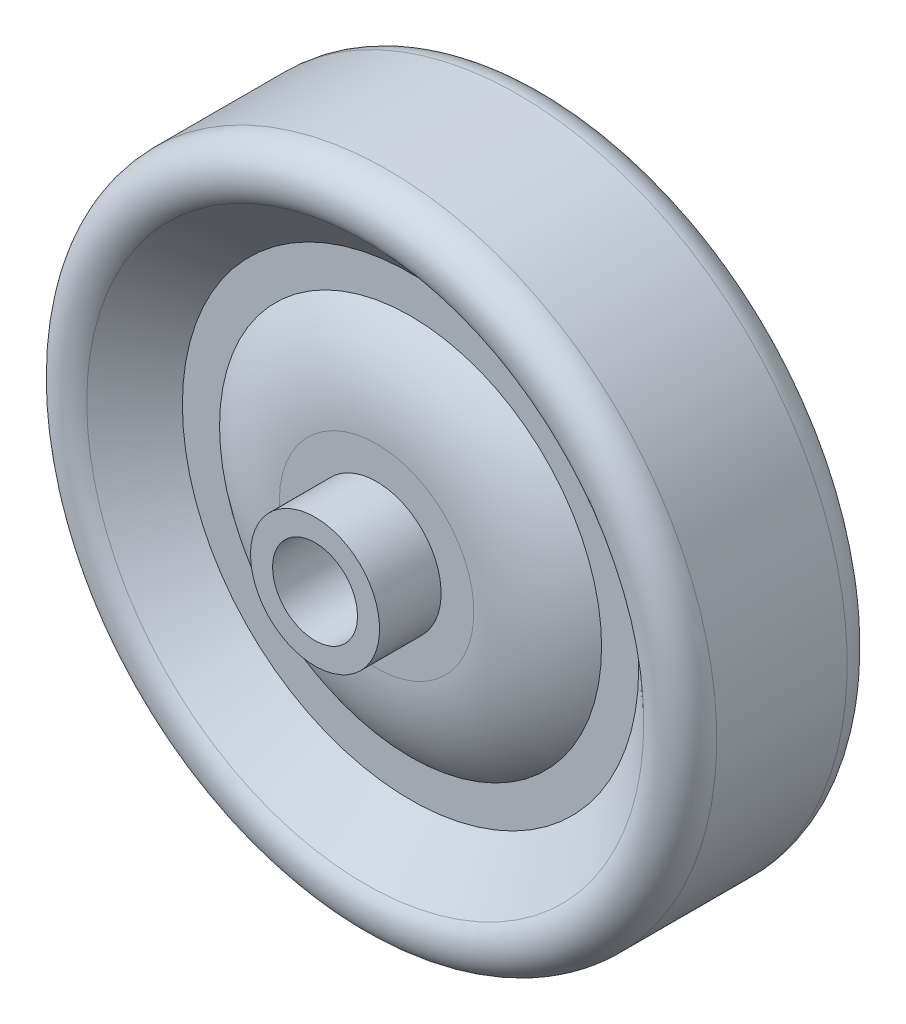
ISO-10303-21;
HEADER;
FILE_DESCRIPTION(('STEP AP214'),'2;1');
FILE_NAME('part.step','',(''),(''),'','','');
FILE_SCHEMA(('AUTOMOTIVE_DESIGN { 1 0 10303 214 1 1 1 1 }'));
ENDSEC;
DATA;
#1=APPLICATION_CONTEXT('core data for automotive mechanical design processes');
#2=APPLICATION_PROTOCOL_DEFINITION('international standard','automotive_design',2000,#1);
#3=PRODUCT_CONTEXT('',#1,'mechanical');
#4=PRODUCT('Part','Part','',(#3));
#5=PRODUCT_RELATED_PRODUCT_CATEGORY('part','',(#4));
#6=PRODUCT_DEFINITION_FORMATION('','',#4);
#7=PRODUCT_DEFINITION_CONTEXT('part definition',#1,'design');
#8=PRODUCT_DEFINITION('design','',#6,#7);
#9=PRODUCT_DEFINITION_SHAPE('','',#8);
#10=(LENGTH_UNIT() NAMED_UNIT(*) SI_UNIT(.MILLI.,.METRE.));
#11=(NAMED_UNIT(*) PLANE_ANGLE_UNIT() SI_UNIT($,.RADIAN.));
#12=(NAMED_UNIT(*) SI_UNIT($,.STERADIAN.) SOLID_ANGLE_UNIT());
#13=UNCERTAINTY_MEASURE_WITH_UNIT(LENGTH_MEASURE(1.E-05),#10,'distance_accuracy_value','');
#14=(GEOMETRIC_REPRESENTATION_CONTEXT(3) GLOBAL_UNCERTAINTY_ASSIGNED_CONTEXT((#13)) GLOBAL_UNIT_ASSIGNED_CONTEXT((#10,
#11,#12)) REPRESENTATION_CONTEXT('',''));
#15=CARTESIAN_POINT('',(0.,0.,0.));
#16=DIRECTION('',(0.,0.,1.));
#17=DIRECTION('',(1.,0.,0.));
#18=AXIS2_PLACEMENT_3D('',#15,#16,#17);
#19=CARTESIAN_POINT('',(0.,0.,-10.31875));
#20=DIRECTION('',(0.,0.,-1.));
#21=DIRECTION('',(-1.,0.,0.));
#22=AXIS2_PLACEMENT_3D('',#19,#20,#21);
#23=CYLINDRICAL_SURFACE('',#22,24.60625);
#24=CARTESIAN_POINT('',(0.,0.,-4.88156249999999));
#25=DIRECTION('',(0.,0.,-1.));
#26=DIRECTION('',(-1.,0.,0.));
#27=AXIS2_PLACEMENT_3D('',#24,#25,#26);
#28=CIRCLE('',#27,24.60625);
#29=CARTESIAN_POINT('',(-24.60625,0.,-4.88156249999999));
#30=VERTEX_POINT('',#29);
#31=EDGE_CURVE('E12',#30,#30,#28,.T.);
#32=ORIENTED_EDGE('',*,*,#31,.F.);
#33=EDGE_LOOP('',(#32));
#34=FACE_BOUND('',#33,.T.);
#35=CARTESIAN_POINT('',(0.,0.,4.88156249999999));
#36=DIRECTION('',(0.,0.,-1.));
#37=DIRECTION('',(-1.,0.,0.));
#38=AXIS2_PLACEMENT_3D('',#35,#36,#37);
#39=CIRCLE('',#38,24.60625);
#40=CARTESIAN_POINT('',(-24.60625,0.,4.88156249999999));
#41=VERTEX_POINT('',#40);
#42=EDGE_CURVE('E73',#41,#41,#39,.T.);
#43=ORIENTED_EDGE('',*,*,#42,.T.);
#44=EDGE_LOOP('',(#43));
#45=FACE_BOUND('',#44,.T.);
#46=ADVANCED_FACE('F42',(#34,#45),#23,.T.);
#47=CARTESIAN_POINT('',(0.,0.,-4.88156249999999));
#48=DIRECTION('',(0.,0.,-1.));
#49=DIRECTION('',(-1.,0.,0.));
#50=AXIS2_PLACEMENT_3D('',#47,#48,#49);
#51=TOROIDAL_SURFACE('',#50,22.3440625,2.2621875);
#52=ORIENTED_EDGE('',*,*,#31,.T.);
#53=EDGE_LOOP('',(#52));
#54=FACE_BOUND('',#53,.T.);
#55=CARTESIAN_POINT('',(0.,0.,-6.56315963348468));
#56=DIRECTION('',(0.,0.,-1.));
#57=DIRECTION('',(-1.,0.,0.));
#58=AXIS2_PLACEMENT_3D('',#55,#56,#57);
#59=CIRCLE('',#58,20.8308793102268);
#60=CARTESIAN_POINT('',(-20.8308793102268,0.,-6.56315963348468));
#61=VERTEX_POINT('',#60);
#62=EDGE_CURVE('E48',#61,#61,#59,.T.);
#63=ORIENTED_EDGE('',*,*,#62,.F.);
#64=EDGE_LOOP('',(#63));
#65=FACE_BOUND('',#64,.T.);
#66=ADVANCED_FACE('F117',(#54,#65),#51,.T.);
#67=CARTESIAN_POINT('',(0.,0.,-3.17499999999999));
#68=DIRECTION('',(0.,0.,-1.));
#69=DIRECTION('',(-1.,0.,0.));
#70=AXIS2_PLACEMENT_3D('',#67,#68,#69);
#71=CONICAL_SURFACE('',#70,17.065625,0.838064758287936);
#72=ORIENTED_EDGE('',*,*,#62,.T.);
#73=EDGE_LOOP('',(#72));
#74=FACE_BOUND('',#73,.T.);
#75=CARTESIAN_POINT('',(0.,0.,-3.17499999999999));
#76=DIRECTION('',(0.,0.,-1.));
#77=DIRECTION('',(-1.,0.,0.));
#78=AXIS2_PLACEMENT_3D('',#75,#76,#77);
#79=CIRCLE('',#78,17.065625);
#80=CARTESIAN_POINT('',(-17.065625,0.,-3.17499999999999));
#81=VERTEX_POINT('',#80);
#82=EDGE_CURVE('E52',#81,#81,#79,.T.);
#83=ORIENTED_EDGE('',*,*,#82,.F.);
#84=EDGE_LOOP('',(#83));
#85=FACE_BOUND('',#84,.T.);
#86=ADVANCED_FACE('F122',(#74,#85),#71,.F.);
#87=CARTESIAN_POINT('',(0.,-14.2875,-3.17499999999999));
#88=DIRECTION('',(0.,0.,-1.));
#89=DIRECTION('',(-1.,0.,0.));
#90=AXIS2_PLACEMENT_3D('',#87,#88,#89);
#91=PLANE('',#90);
#92=ORIENTED_EDGE('',*,*,#82,.T.);
#93=EDGE_LOOP('',(#92));
#94=FACE_BOUND('',#93,.T.);
#95=CARTESIAN_POINT('',(0.,0.,-3.17499999999999));
#96=DIRECTION('',(0.,0.,-1.));
#97=DIRECTION('',(-1.,0.,0.));
#98=AXIS2_PLACEMENT_3D('',#95,#96,#97);
#99=CIRCLE('',#98,14.2875);
#100=CARTESIAN_POINT('',(-14.2875,0.,-3.17499999999999));
#101=VERTEX_POINT('',#100);
#102=EDGE_CURVE('E56',#101,#101,#99,.T.);
#103=ORIENTED_EDGE('',*,*,#102,.F.);
#104=EDGE_LOOP('',(#103));
#105=FACE_BOUND('',#104,.T.);
#106=ADVANCED_FACE('F222',(#94,#105),#91,.T.);
#107=CARTESIAN_POINT('',(0.,0.,5.25045778842444));
#108=DIRECTION('',(0.,0.,-1.));
#109=DIRECTION('',(-1.,0.,0.));
#110=AXIS2_PLACEMENT_3D('',#107,#108,#109);
#111=DEGENERATE_TOROIDAL_SURFACE('',#110,7.26945714139644,10.9654577884244,.T.);
#112=ORIENTED_EDGE('',*,*,#102,.T.);
#113=EDGE_LOOP('',(#112));
#114=FACE_BOUND('',#113,.T.);
#115=CARTESIAN_POINT('',(0.,0.,-5.715));
#116=DIRECTION('',(0.,0.,-1.));
#117=DIRECTION('',(-1.,0.,0.));
#118=AXIS2_PLACEMENT_3D('',#115,#116,#117);
#119=CIRCLE('',#118,7.26945714139644);
#120=CARTESIAN_POINT('',(-7.26945714139644,0.,-5.715));
#121=VERTEX_POINT('',#120);
#122=EDGE_CURVE('E61',#121,#121,#119,.T.);
#123=ORIENTED_EDGE('',*,*,#122,.F.);
#124=EDGE_LOOP('',(#123));
#125=FACE_BOUND('',#124,.T.);
#126=ADVANCED_FACE('F213',(#114,#125),#111,.T.);
#127=CARTESIAN_POINT('',(0.,-7.26945714139645,-5.715));
#128=DIRECTION('',(0.,0.,-1.));
#129=DIRECTION('',(-1.,0.,0.));
#130=AXIS2_PLACEMENT_3D('',#127,#128,#129);
#131=PLANE('',#130);
#132=ORIENTED_EDGE('',*,*,#122,.T.);
#133=EDGE_LOOP('',(#132));
#134=FACE_BOUND('',#133,.T.);
#135=CARTESIAN_POINT('',(0.,0.,-5.715));
#136=DIRECTION('',(0.,0.,-1.));
#137=DIRECTION('',(-1.,0.,0.));
#138=AXIS2_PLACEMENT_3D('',#135,#136,#137);
#139=CIRCLE('',#138,4.826);
#140=CARTESIAN_POINT('',(-4.826,0.,-5.715));
#141=VERTEX_POINT('',#140);
#142=EDGE_CURVE('E64',#141,#141,#139,.T.);
#143=ORIENTED_EDGE('',*,*,#142,.F.);
#144=EDGE_LOOP('',(#143));
#145=FACE_BOUND('',#144,.T.);
#146=ADVANCED_FACE('F204',(#134,#145),#131,.T.);
#147=CARTESIAN_POINT('',(0.,0.,-10.31875));
#148=DIRECTION('',(0.,0.,-1.));
#149=DIRECTION('',(-1.,0.,0.));
#150=AXIS2_PLACEMENT_3D('',#147,#148,#149);
#151=CYLINDRICAL_SURFACE('',#150,4.826);
#152=ORIENTED_EDGE('',*,*,#142,.T.);
#153=EDGE_LOOP('',(#152));
#154=FACE_BOUND('',#153,.T.);
#155=CARTESIAN_POINT('',(0.,0.,-10.31875));
#156=DIRECTION('',(0.,0.,-1.));
#157=DIRECTION('',(-1.,0.,0.));
#158=AXIS2_PLACEMENT_3D('',#155,#156,#157);
#159=CIRCLE('',#158,4.826);
#160=CARTESIAN_POINT('',(-4.826,0.,-10.31875));
#161=VERTEX_POINT('',#160);
#162=EDGE_CURVE('E67',#161,#161,#159,.T.);
#163=ORIENTED_EDGE('',*,*,#162,.F.);
#164=EDGE_LOOP('',(#163));
#165=FACE_BOUND('',#164,.T.);
#166=ADVANCED_FACE('F113',(#154,#165),#151,.T.);
#167=CARTESIAN_POINT('',(0.,-3.175,-10.31875));
#168=DIRECTION('',(0.,0.,-1.));
#169=DIRECTION('',(-1.,0.,0.));
#170=AXIS2_PLACEMENT_3D('',#167,#168,#169);
#171=PLANE('',#170);
#172=ORIENTED_EDGE('',*,*,#162,.T.);
#173=EDGE_LOOP('',(#172));
#174=FACE_BOUND('',#173,.T.);
#175=CARTESIAN_POINT('',(0.,0.,-10.31875));
#176=DIRECTION('',(0.,0.,-1.));
#177=DIRECTION('',(-1.,0.,0.));
#178=AXIS2_PLACEMENT_3D('',#175,#176,#177);
#179=CIRCLE('',#178,3.175);
#180=CARTESIAN_POINT('',(-3.175,0.,-10.31875));
#181=VERTEX_POINT('',#180);
#182=EDGE_CURVE('E70',#181,#181,#179,.T.);
#183=ORIENTED_EDGE('',*,*,#182,.F.);
#184=EDGE_LOOP('',(#183));
#185=FACE_BOUND('',#184,.T.);
#186=ADVANCED_FACE('F103',(#174,#185),#171,.T.);
#187=CARTESIAN_POINT('',(0.,0.,-10.31875));
#188=DIRECTION('',(0.,0.,-1.));
#189=DIRECTION('',(-1.,0.,0.));
#190=AXIS2_PLACEMENT_3D('',#187,#188,#189);
#191=CYLINDRICAL_SURFACE('',#190,3.175);
#192=ORIENTED_EDGE('',*,*,#182,.T.);
#193=EDGE_LOOP('',(#192));
#194=FACE_BOUND('',#193,.T.);
#195=CARTESIAN_POINT('',(0.,0.,10.31875));
#196=DIRECTION('',(0.,0.,-1.));
#197=DIRECTION('',(-1.,0.,0.));
#198=AXIS2_PLACEMENT_3D('',#195,#196,#197);
#199=CIRCLE('',#198,3.175);
#200=CARTESIAN_POINT('',(-3.175,0.,10.31875));
#201=VERTEX_POINT('',#200);
#202=EDGE_CURVE('E94',#201,#201,#199,.T.);
#203=ORIENTED_EDGE('',*,*,#202,.F.);
#204=EDGE_LOOP('',(#203));
#205=FACE_BOUND('',#204,.T.);
#206=ADVANCED_FACE('F100',(#194,#205),#191,.F.);
#207=CARTESIAN_POINT('',(0.,0.,4.88156249999999));
#208=DIRECTION('',(0.,0.,1.));
#209=DIRECTION('',(-1.,0.,0.));
#210=AXIS2_PLACEMENT_3D('',#207,#208,#209);
#211=TOROIDAL_SURFACE('',#210,22.3440625,2.2621875);
#212=ORIENTED_EDGE('',*,*,#42,.F.);
#213=EDGE_LOOP('',(#212));
#214=FACE_BOUND('',#213,.T.);
#215=CARTESIAN_POINT('',(0.,0.,6.56315963348468));
#216=DIRECTION('',(0.,0.,-1.));
#217=DIRECTION('',(-1.,0.,0.));
#218=AXIS2_PLACEMENT_3D('',#215,#216,#217);
#219=CIRCLE('',#218,20.8308793102268);
#220=CARTESIAN_POINT('',(-20.8308793102268,0.,6.56315963348468));
#221=VERTEX_POINT('',#220);
#222=EDGE_CURVE('E76',#221,#221,#219,.T.);
#223=ORIENTED_EDGE('',*,*,#222,.T.);
#224=EDGE_LOOP('',(#223));
#225=FACE_BOUND('',#224,.T.);
#226=ADVANCED_FACE('F102',(#214,#225),#211,.T.);
#227=CARTESIAN_POINT('',(0.,0.,3.17499999999999));
#228=DIRECTION('',(0.,0.,1.));
#229=DIRECTION('',(-1.,0.,0.));
#230=AXIS2_PLACEMENT_3D('',#227,#228,#229);
#231=CONICAL_SURFACE('',#230,17.065625,0.838064758287936);
#232=ORIENTED_EDGE('',*,*,#222,.F.);
#233=EDGE_LOOP('',(#232));
#234=FACE_BOUND('',#233,.T.);
#235=CARTESIAN_POINT('',(0.,0.,3.17499999999999));
#236=DIRECTION('',(0.,0.,-1.));
#237=DIRECTION('',(-1.,0.,0.));
#238=AXIS2_PLACEMENT_3D('',#235,#236,#237);
#239=CIRCLE('',#238,17.065625);
#240=CARTESIAN_POINT('',(-17.065625,0.,3.17499999999999));
#241=VERTEX_POINT('',#240);
#242=EDGE_CURVE('E79',#241,#241,#239,.T.);
#243=ORIENTED_EDGE('',*,*,#242,.T.);
#244=EDGE_LOOP('',(#243));
#245=FACE_BOUND('',#244,.T.);
#246=ADVANCED_FACE('F110',(#234,#245),#231,.F.);
#247=CARTESIAN_POINT('',(0.,-14.2875,3.17499999999999));
#248=DIRECTION('',(0.,0.,1.));
#249=DIRECTION('',(-1.,0.,0.));
#250=AXIS2_PLACEMENT_3D('',#247,#248,#249);
#251=PLANE('',#250);
#252=ORIENTED_EDGE('',*,*,#242,.F.);
#253=EDGE_LOOP('',(#252));
#254=FACE_BOUND('',#253,.T.);
#255=CARTESIAN_POINT('',(0.,0.,3.17499999999999));
#256=DIRECTION('',(0.,0.,-1.));
#257=DIRECTION('',(-1.,0.,0.));
#258=AXIS2_PLACEMENT_3D('',#255,#256,#257);
#259=CIRCLE('',#258,14.2875);
#260=CARTESIAN_POINT('',(-14.2875,0.,3.17499999999999));
#261=VERTEX_POINT('',#260);
#262=EDGE_CURVE('E82',#261,#261,#259,.T.);
#263=ORIENTED_EDGE('',*,*,#262,.T.);
#264=EDGE_LOOP('',(#263));
#265=FACE_BOUND('',#264,.T.);
#266=ADVANCED_FACE('F130',(#254,#265),#251,.T.);
#267=CARTESIAN_POINT('',(0.,0.,-5.25045778842444));
#268=DIRECTION('',(0.,0.,1.));
#269=DIRECTION('',(-1.,0.,0.));
#270=AXIS2_PLACEMENT_3D('',#267,#268,#269);
#271=DEGENERATE_TOROIDAL_SURFACE('',#270,7.26945714139644,10.9654577884244,.T.);
#272=ORIENTED_EDGE('',*,*,#262,.F.);
#273=EDGE_LOOP('',(#272));
#274=FACE_BOUND('',#273,.T.);
#275=CARTESIAN_POINT('',(0.,0.,5.715));
#276=DIRECTION('',(0.,0.,-1.));
#277=DIRECTION('',(-1.,0.,0.));
#278=AXIS2_PLACEMENT_3D('',#275,#276,#277);
#279=CIRCLE('',#278,7.26945714139644);
#280=CARTESIAN_POINT('',(-7.26945714139644,0.,5.715));
#281=VERTEX_POINT('',#280);
#282=EDGE_CURVE('E85',#281,#281,#279,.T.);
#283=ORIENTED_EDGE('',*,*,#282,.T.);
#284=EDGE_LOOP('',(#283));
#285=FACE_BOUND('',#284,.T.);
#286=ADVANCED_FACE('F136',(#274,#285),#271,.T.);
#287=CARTESIAN_POINT('',(0.,-7.26945714139645,5.715));
#288=DIRECTION('',(0.,0.,1.));
#289=DIRECTION('',(-1.,0.,0.));
#290=AXIS2_PLACEMENT_3D('',#287,#288,#289);
#291=PLANE('',#290);
#292=ORIENTED_EDGE('',*,*,#282,.F.);
#293=EDGE_LOOP('',(#292));
#294=FACE_BOUND('',#293,.T.);
#295=CARTESIAN_POINT('',(0.,0.,5.715));
#296=DIRECTION('',(0.,0.,-1.));
#297=DIRECTION('',(-1.,0.,0.));
#298=AXIS2_PLACEMENT_3D('',#295,#296,#297);
#299=CIRCLE('',#298,4.826);
#300=CARTESIAN_POINT('',(-4.826,0.,5.715));
#301=VERTEX_POINT('',#300);
#302=EDGE_CURVE('E88',#301,#301,#299,.T.);
#303=ORIENTED_EDGE('',*,*,#302,.T.);
#304=EDGE_LOOP('',(#303));
#305=FACE_BOUND('',#304,.T.);
#306=ADVANCED_FACE('F142',(#294,#305),#291,.T.);
#307=CARTESIAN_POINT('',(0.,0.,10.31875));
#308=DIRECTION('',(0.,0.,1.));
#309=DIRECTION('',(-1.,0.,0.));
#310=AXIS2_PLACEMENT_3D('',#307,#308,#309);
#311=CYLINDRICAL_SURFACE('',#310,4.826);
#312=ORIENTED_EDGE('',*,*,#302,.F.);
#313=EDGE_LOOP('',(#312));
#314=FACE_BOUND('',#313,.T.);
#315=CARTESIAN_POINT('',(0.,0.,10.31875));
#316=DIRECTION('',(0.,0.,-1.));
#317=DIRECTION('',(-1.,0.,0.));
#318=AXIS2_PLACEMENT_3D('',#315,#316,#317);
#319=CIRCLE('',#318,4.826);
#320=CARTESIAN_POINT('',(-4.826,0.,10.31875));
#321=VERTEX_POINT('',#320);
#322=EDGE_CURVE('E91',#321,#321,#319,.T.);
#323=ORIENTED_EDGE('',*,*,#322,.T.);
#324=EDGE_LOOP('',(#323));
#325=FACE_BOUND('',#324,.T.);
#326=ADVANCED_FACE('F148',(#314,#325),#311,.T.);
#327=CARTESIAN_POINT('',(0.,-3.175,10.31875));
#328=DIRECTION('',(0.,0.,1.));
#329=DIRECTION('',(-1.,0.,0.));
#330=AXIS2_PLACEMENT_3D('',#327,#328,#329);
#331=PLANE('',#330);
#332=ORIENTED_EDGE('',*,*,#322,.F.);
#333=EDGE_LOOP('',(#332));
#334=FACE_BOUND('',#333,.T.);
#335=ORIENTED_EDGE('',*,*,#202,.T.);
#336=EDGE_LOOP('',(#335));
#337=FACE_BOUND('',#336,.T.);
#338=ADVANCED_FACE('F98',(#334,#337),#331,.T.);
#339=CLOSED_SHELL('',(#46,#66,#86,#106,#126,#146,#166,#186,#206,#226,#246,#266,#286,#306,#326,#338));
#340=MANIFOLD_SOLID_BREP('B2',#339);
#341=ADVANCED_BREP_SHAPE_REPRESENTATION('',(#18,#340),#14);
#342=SHAPE_DEFINITION_REPRESENTATION(#9,#341);
ENDSEC;
END-ISO-10303-21;
